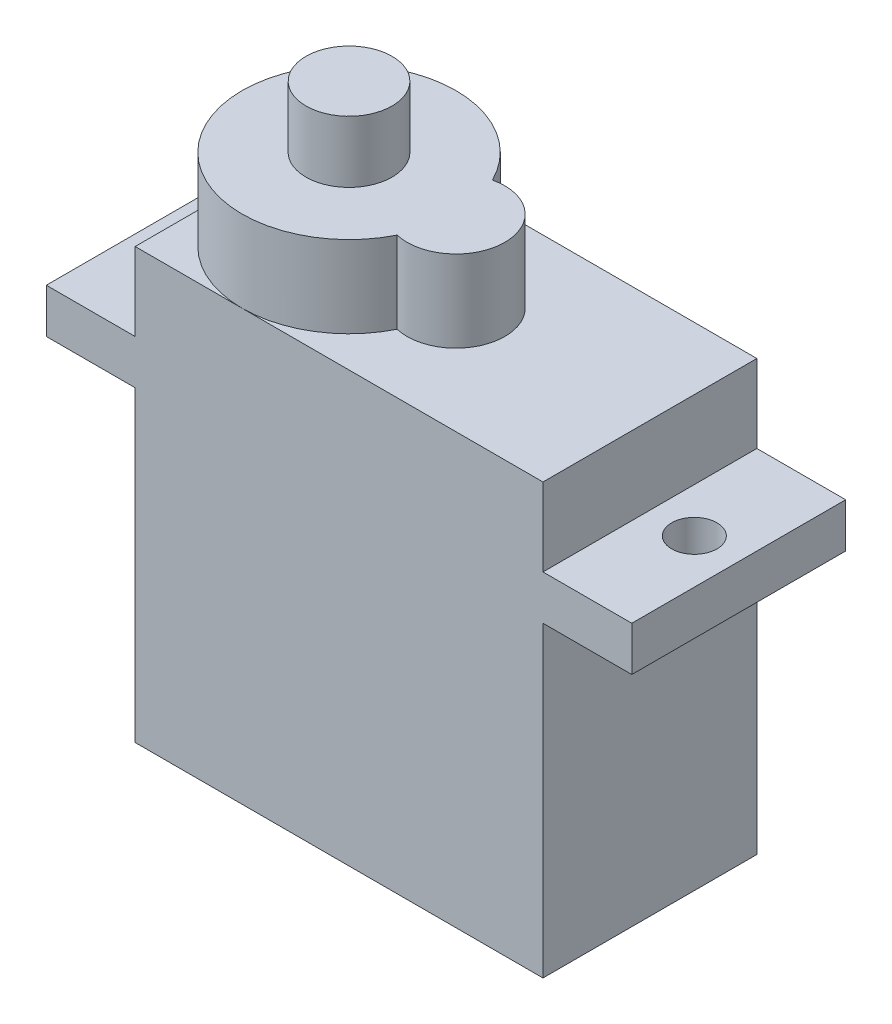
ISO-10303-21;
HEADER;
FILE_DESCRIPTION(('STEP AP214'),'2;1');
FILE_NAME('part.step','',(''),(''),'','','');
FILE_SCHEMA(('AUTOMOTIVE_DESIGN { 1 0 10303 214 1 1 1 1 }'));
ENDSEC;
DATA;
#1=APPLICATION_CONTEXT('core data for automotive mechanical design processes');
#2=APPLICATION_PROTOCOL_DEFINITION('international standard','automotive_design',2000,#1);
#3=PRODUCT_CONTEXT('',#1,'mechanical');
#4=PRODUCT('Part','Part','',(#3));
#5=PRODUCT_RELATED_PRODUCT_CATEGORY('part','',(#4));
#6=PRODUCT_DEFINITION_FORMATION('','',#4);
#7=PRODUCT_DEFINITION_CONTEXT('part definition',#1,'design');
#8=PRODUCT_DEFINITION('design','',#6,#7);
#9=PRODUCT_DEFINITION_SHAPE('','',#8);
#10=(LENGTH_UNIT() NAMED_UNIT(*) SI_UNIT(.MILLI.,.METRE.));
#11=(NAMED_UNIT(*) PLANE_ANGLE_UNIT() SI_UNIT($,.RADIAN.));
#12=(NAMED_UNIT(*) SI_UNIT($,.STERADIAN.) SOLID_ANGLE_UNIT());
#13=UNCERTAINTY_MEASURE_WITH_UNIT(LENGTH_MEASURE(1.E-05),#10,'distance_accuracy_value','');
#14=(GEOMETRIC_REPRESENTATION_CONTEXT(3) GLOBAL_UNCERTAINTY_ASSIGNED_CONTEXT((#13)) GLOBAL_UNIT_ASSIGNED_CONTEXT((#10,
#11,#12)) REPRESENTATION_CONTEXT('',''));
#15=CARTESIAN_POINT('',(0.,0.,0.));
#16=DIRECTION('',(0.,0.,1.));
#17=DIRECTION('',(1.,0.,0.));
#18=AXIS2_PLACEMENT_3D('',#15,#16,#17);
#19=CARTESIAN_POINT('',(0.,23.7,11.8));
#20=DIRECTION('',(0.,-1.,0.));
#21=DIRECTION('',(0.,0.,-1.));
#22=AXIS2_PLACEMENT_3D('',#19,#20,#21);
#23=PLANE('',#22);
#24=CARTESIAN_POINT('',(11.8,23.7,5.9));
#25=DIRECTION('',(0.,1.,0.));
#26=DIRECTION('',(0.,0.,1.));
#27=AXIS2_PLACEMENT_3D('',#24,#25,#26);
#28=CIRCLE('',#27,2.7);
#29=CARTESIAN_POINT('',(11.1822033898305,23.7,8.52836971304706));
#30=VERTEX_POINT('',#29);
#31=CARTESIAN_POINT('',(11.1822033898305,23.7,3.27163028695294));
#32=VERTEX_POINT('',#31);
#33=EDGE_CURVE('E166',#30,#32,#28,.T.);
#34=ORIENTED_EDGE('',*,*,#33,.F.);
#35=CARTESIAN_POINT('',(5.90000000000001,23.7,5.9));
#36=DIRECTION('',(0.,1.,0.));
#37=DIRECTION('',(0.,0.,1.));
#38=AXIS2_PLACEMENT_3D('',#35,#36,#37);
#39=CIRCLE('',#38,5.9);
#40=CARTESIAN_POINT('',(5.90000000000001,23.7,11.8));
#41=VERTEX_POINT('',#40);
#42=EDGE_CURVE('E61',#41,#30,#39,.T.);
#43=ORIENTED_EDGE('',*,*,#42,.F.);
#44=DIRECTION('',(-1.,0.,0.));
#45=VECTOR('',#44,1.);
#46=CARTESIAN_POINT('',(0.,23.7,11.8));
#47=LINE('',#46,#45);
#48=CARTESIAN_POINT('',(22.5,23.7,11.8));
#49=VERTEX_POINT('',#48);
#50=EDGE_CURVE('E191',#49,#41,#47,.T.);
#51=ORIENTED_EDGE('',*,*,#50,.F.);
#52=DIRECTION('',(0.,0.,-1.));
#53=VECTOR('',#52,1.);
#54=CARTESIAN_POINT('',(22.5,23.7,11.8));
#55=LINE('',#54,#53);
#56=CARTESIAN_POINT('',(22.5,23.7,0.));
#57=VERTEX_POINT('',#56);
#58=EDGE_CURVE('E239',#49,#57,#55,.T.);
#59=ORIENTED_EDGE('',*,*,#58,.T.);
#60=DIRECTION('',(-1.,0.,0.));
#61=VECTOR('',#60,1.);
#62=CARTESIAN_POINT('',(0.,23.7,0.));
#63=LINE('',#62,#61);
#64=CARTESIAN_POINT('',(5.90000000000001,23.7,0.));
#65=VERTEX_POINT('',#64);
#66=EDGE_CURVE('E215',#57,#65,#63,.T.);
#67=ORIENTED_EDGE('',*,*,#66,.T.);
#68=EDGE_CURVE('E49',#32,#65,#39,.T.);
#69=ORIENTED_EDGE('',*,*,#68,.F.);
#70=EDGE_LOOP('',(#34,#43,#51,#59,#67,#69));
#71=FACE_BOUND('',#70,.T.);
#72=ADVANCED_FACE('F38',(#71),#23,.F.);
#73=CARTESIAN_POINT('',(0.,23.7,5.9));
#74=VERTEX_POINT('',#73);
#75=EDGE_CURVE('E11',#65,#74,#39,.T.);
#76=ORIENTED_EDGE('',*,*,#75,.F.);
#77=CARTESIAN_POINT('',(0.,23.7,0.));
#78=VERTEX_POINT('',#77);
#79=EDGE_CURVE('E214',#65,#78,#63,.T.);
#80=ORIENTED_EDGE('',*,*,#79,.T.);
#81=DIRECTION('',(0.,0.,-1.));
#82=VECTOR('',#81,1.);
#83=CARTESIAN_POINT('',(0.,23.7,11.8));
#84=LINE('',#83,#82);
#85=EDGE_CURVE('E235',#74,#78,#84,.T.);
#86=ORIENTED_EDGE('',*,*,#85,.F.);
#87=EDGE_LOOP('',(#76,#80,#86));
#88=FACE_BOUND('',#87,.T.);
#89=ADVANCED_FACE('F346',(#88),#23,.F.);
#90=CARTESIAN_POINT('',(0.,0.,11.8));
#91=DIRECTION('',(1.,0.,0.));
#92=DIRECTION('',(0.,0.,-1.));
#93=AXIS2_PLACEMENT_3D('',#90,#91,#92);
#94=PLANE('',#93);
#95=DIRECTION('',(0.,-1.,0.));
#96=VECTOR('',#95,1.);
#97=CARTESIAN_POINT('',(0.,0.,0.));
#98=LINE('',#97,#96);
#99=CARTESIAN_POINT('',(0.,16.95,0.));
#100=VERTEX_POINT('',#99);
#101=CARTESIAN_POINT('',(0.,0.,0.));
#102=VERTEX_POINT('',#101);
#103=EDGE_CURVE('E167',#100,#102,#98,.T.);
#104=ORIENTED_EDGE('',*,*,#103,.T.);
#105=DIRECTION('',(0.,0.,-1.));
#106=VECTOR('',#105,1.);
#107=CARTESIAN_POINT('',(0.,0.,11.8));
#108=LINE('',#107,#106);
#109=CARTESIAN_POINT('',(0.,0.,11.8));
#110=VERTEX_POINT('',#109);
#111=EDGE_CURVE('E42',#110,#102,#108,.T.);
#112=ORIENTED_EDGE('',*,*,#111,.F.);
#113=DIRECTION('',(0.,-1.,0.));
#114=VECTOR('',#113,1.);
#115=CARTESIAN_POINT('',(0.,0.,11.8));
#116=LINE('',#115,#114);
#117=CARTESIAN_POINT('',(0.,16.95,11.8));
#118=VERTEX_POINT('',#117);
#119=EDGE_CURVE('E174',#118,#110,#116,.T.);
#120=ORIENTED_EDGE('',*,*,#119,.F.);
#121=DIRECTION('',(0.,0.,-1.));
#122=VECTOR('',#121,1.);
#123=CARTESIAN_POINT('',(0.,16.95,11.8));
#124=LINE('',#123,#122);
#125=EDGE_CURVE('E201',#118,#100,#124,.T.);
#126=ORIENTED_EDGE('',*,*,#125,.T.);
#127=EDGE_LOOP('',(#104,#112,#120,#126));
#128=FACE_BOUND('',#127,.T.);
#129=ADVANCED_FACE('F40',(#128),#94,.F.);
#130=CARTESIAN_POINT('',(0.,0.,11.8));
#131=DIRECTION('',(0.,1.,0.));
#132=DIRECTION('',(0.,0.,1.));
#133=AXIS2_PLACEMENT_3D('',#130,#131,#132);
#134=PLANE('',#133);
#135=DIRECTION('',(1.,0.,0.));
#136=VECTOR('',#135,1.);
#137=CARTESIAN_POINT('',(0.,0.,0.));
#138=LINE('',#137,#136);
#139=CARTESIAN_POINT('',(22.5,0.,0.));
#140=VERTEX_POINT('',#139);
#141=EDGE_CURVE('E170',#102,#140,#138,.T.);
#142=ORIENTED_EDGE('',*,*,#141,.T.);
#143=DIRECTION('',(0.,0.,-1.));
#144=VECTOR('',#143,1.);
#145=CARTESIAN_POINT('',(22.5,0.,11.8));
#146=LINE('',#145,#144);
#147=CARTESIAN_POINT('',(22.5,0.,11.8));
#148=VERTEX_POINT('',#147);
#149=EDGE_CURVE('E253',#148,#140,#146,.T.);
#150=ORIENTED_EDGE('',*,*,#149,.F.);
#151=DIRECTION('',(1.,0.,0.));
#152=VECTOR('',#151,1.);
#153=CARTESIAN_POINT('',(0.,0.,11.8));
#154=LINE('',#153,#152);
#155=EDGE_CURVE('E177',#110,#148,#154,.T.);
#156=ORIENTED_EDGE('',*,*,#155,.F.);
#157=ORIENTED_EDGE('',*,*,#111,.T.);
#158=EDGE_LOOP('',(#142,#150,#156,#157));
#159=FACE_BOUND('',#158,.T.);
#160=ADVANCED_FACE('F353',(#159),#134,.F.);
#161=CARTESIAN_POINT('',(22.5,0.,11.8));
#162=DIRECTION('',(-1.,0.,0.));
#163=DIRECTION('',(0.,0.,1.));
#164=AXIS2_PLACEMENT_3D('',#161,#162,#163);
#165=PLANE('',#164);
#166=DIRECTION('',(0.,1.,0.));
#167=VECTOR('',#166,1.);
#168=CARTESIAN_POINT('',(22.5,0.,0.));
#169=LINE('',#168,#167);
#170=CARTESIAN_POINT('',(22.5,16.95,0.));
#171=VERTEX_POINT('',#170);
#172=EDGE_CURVE('E204',#140,#171,#169,.T.);
#173=ORIENTED_EDGE('',*,*,#172,.T.);
#174=DIRECTION('',(0.,0.,-1.));
#175=VECTOR('',#174,1.);
#176=CARTESIAN_POINT('',(22.5,16.95,11.8));
#177=LINE('',#176,#175);
#178=CARTESIAN_POINT('',(22.5,16.95,11.8));
#179=VERTEX_POINT('',#178);
#180=EDGE_CURVE('E251',#179,#171,#177,.T.);
#181=ORIENTED_EDGE('',*,*,#180,.F.);
#182=DIRECTION('',(0.,1.,0.));
#183=VECTOR('',#182,1.);
#184=CARTESIAN_POINT('',(22.5,0.,11.8));
#185=LINE('',#184,#183);
#186=EDGE_CURVE('E180',#148,#179,#185,.T.);
#187=ORIENTED_EDGE('',*,*,#186,.F.);
#188=ORIENTED_EDGE('',*,*,#149,.T.);
#189=EDGE_LOOP('',(#173,#181,#187,#188));
#190=FACE_BOUND('',#189,.T.);
#191=ADVANCED_FACE('F343',(#190),#165,.F.);
#192=CARTESIAN_POINT('',(27.4,16.95,11.8));
#193=DIRECTION('',(0.,1.,0.));
#194=DIRECTION('',(0.,0.,1.));
#195=AXIS2_PLACEMENT_3D('',#192,#193,#194);
#196=PLANE('',#195);
#197=CARTESIAN_POINT('',(24.95,16.95,5.9));
#198=DIRECTION('',(0.,1.,0.));
#199=DIRECTION('',(0.,0.,1.));
#200=AXIS2_PLACEMENT_3D('',#197,#198,#199);
#201=CIRCLE('',#200,1.25);
#202=CARTESIAN_POINT('',(24.95,16.95,7.15));
#203=VERTEX_POINT('',#202);
#204=EDGE_CURVE('E272',#203,#203,#201,.F.);
#205=ORIENTED_EDGE('',*,*,#204,.F.);
#206=EDGE_LOOP('',(#205));
#207=FACE_BOUND('',#206,.T.);
#208=DIRECTION('',(1.,0.,0.));
#209=VECTOR('',#208,1.);
#210=CARTESIAN_POINT('',(27.4,16.95,0.));
#211=LINE('',#210,#209);
#212=CARTESIAN_POINT('',(27.4,16.95,0.));
#213=VERTEX_POINT('',#212);
#214=EDGE_CURVE('E206',#171,#213,#211,.T.);
#215=ORIENTED_EDGE('',*,*,#214,.T.);
#216=DIRECTION('',(0.,0.,-1.));
#217=VECTOR('',#216,1.);
#218=CARTESIAN_POINT('',(27.4,16.95,11.8));
#219=LINE('',#218,#217);
#220=CARTESIAN_POINT('',(27.4,16.95,11.8));
#221=VERTEX_POINT('',#220);
#222=EDGE_CURVE('E248',#221,#213,#219,.T.);
#223=ORIENTED_EDGE('',*,*,#222,.F.);
#224=DIRECTION('',(1.,0.,0.));
#225=VECTOR('',#224,1.);
#226=CARTESIAN_POINT('',(27.4,16.95,11.8));
#227=LINE('',#226,#225);
#228=EDGE_CURVE('E182',#179,#221,#227,.T.);
#229=ORIENTED_EDGE('',*,*,#228,.F.);
#230=ORIENTED_EDGE('',*,*,#180,.T.);
#231=EDGE_LOOP('',(#215,#223,#229,#230));
#232=FACE_BOUND('',#231,.T.);
#233=ADVANCED_FACE('F341',(#207,#232),#196,.F.);
#234=CARTESIAN_POINT('',(27.4,19.4,11.8));
#235=DIRECTION('',(-1.,0.,0.));
#236=DIRECTION('',(0.,0.,1.));
#237=AXIS2_PLACEMENT_3D('',#234,#235,#236);
#238=PLANE('',#237);
#239=DIRECTION('',(0.,1.,0.));
#240=VECTOR('',#239,1.);
#241=CARTESIAN_POINT('',(27.4,19.4,0.));
#242=LINE('',#241,#240);
#243=CARTESIAN_POINT('',(27.4,19.4,0.));
#244=VERTEX_POINT('',#243);
#245=EDGE_CURVE('E208',#213,#244,#242,.T.);
#246=ORIENTED_EDGE('',*,*,#245,.T.);
#247=DIRECTION('',(0.,0.,-1.));
#248=VECTOR('',#247,1.);
#249=CARTESIAN_POINT('',(27.4,19.4,11.8));
#250=LINE('',#249,#248);
#251=CARTESIAN_POINT('',(27.4,19.4,11.8));
#252=VERTEX_POINT('',#251);
#253=EDGE_CURVE('E245',#252,#244,#250,.T.);
#254=ORIENTED_EDGE('',*,*,#253,.F.);
#255=DIRECTION('',(0.,1.,0.));
#256=VECTOR('',#255,1.);
#257=CARTESIAN_POINT('',(27.4,19.4,11.8));
#258=LINE('',#257,#256);
#259=EDGE_CURVE('E184',#221,#252,#258,.T.);
#260=ORIENTED_EDGE('',*,*,#259,.F.);
#261=ORIENTED_EDGE('',*,*,#222,.T.);
#262=EDGE_LOOP('',(#246,#254,#260,#261));
#263=FACE_BOUND('',#262,.T.);
#264=ADVANCED_FACE('F337',(#263),#238,.F.);
#265=CARTESIAN_POINT('',(22.5,19.4,11.8));
#266=DIRECTION('',(0.,-1.,0.));
#267=DIRECTION('',(0.,0.,-1.));
#268=AXIS2_PLACEMENT_3D('',#265,#266,#267);
#269=PLANE('',#268);
#270=CARTESIAN_POINT('',(24.95,19.4,5.9));
#271=DIRECTION('',(0.,1.,0.));
#272=DIRECTION('',(0.,0.,1.));
#273=AXIS2_PLACEMENT_3D('',#270,#271,#272);
#274=CIRCLE('',#273,1.25);
#275=CARTESIAN_POINT('',(24.95,19.4,7.15));
#276=VERTEX_POINT('',#275);
#277=EDGE_CURVE('E276',#276,#276,#274,.T.);
#278=ORIENTED_EDGE('',*,*,#277,.F.);
#279=EDGE_LOOP('',(#278));
#280=FACE_BOUND('',#279,.T.);
#281=DIRECTION('',(-1.,0.,0.));
#282=VECTOR('',#281,1.);
#283=CARTESIAN_POINT('',(22.5,19.4,0.));
#284=LINE('',#283,#282);
#285=CARTESIAN_POINT('',(22.5,19.4,0.));
#286=VERTEX_POINT('',#285);
#287=EDGE_CURVE('E210',#244,#286,#284,.T.);
#288=ORIENTED_EDGE('',*,*,#287,.T.);
#289=DIRECTION('',(0.,0.,-1.));
#290=VECTOR('',#289,1.);
#291=CARTESIAN_POINT('',(22.5,19.4,11.8));
#292=LINE('',#291,#290);
#293=CARTESIAN_POINT('',(22.5,19.4,11.8));
#294=VERTEX_POINT('',#293);
#295=EDGE_CURVE('E242',#294,#286,#292,.T.);
#296=ORIENTED_EDGE('',*,*,#295,.F.);
#297=DIRECTION('',(-1.,0.,0.));
#298=VECTOR('',#297,1.);
#299=CARTESIAN_POINT('',(22.5,19.4,11.8));
#300=LINE('',#299,#298);
#301=EDGE_CURVE('E186',#252,#294,#300,.T.);
#302=ORIENTED_EDGE('',*,*,#301,.F.);
#303=ORIENTED_EDGE('',*,*,#253,.T.);
#304=EDGE_LOOP('',(#288,#296,#302,#303));
#305=FACE_BOUND('',#304,.T.);
#306=ADVANCED_FACE('F332',(#280,#305),#269,.F.);
#307=CARTESIAN_POINT('',(22.5,19.4,11.8));
#308=DIRECTION('',(-1.,0.,0.));
#309=DIRECTION('',(0.,0.,1.));
#310=AXIS2_PLACEMENT_3D('',#307,#308,#309);
#311=PLANE('',#310);
#312=DIRECTION('',(0.,1.,0.));
#313=VECTOR('',#312,1.);
#314=CARTESIAN_POINT('',(22.5,19.4,0.));
#315=LINE('',#314,#313);
#316=EDGE_CURVE('E212',#286,#57,#315,.T.);
#317=ORIENTED_EDGE('',*,*,#316,.T.);
#318=ORIENTED_EDGE('',*,*,#58,.F.);
#319=DIRECTION('',(0.,1.,0.));
#320=VECTOR('',#319,1.);
#321=CARTESIAN_POINT('',(22.5,19.4,11.8));
#322=LINE('',#321,#320);
#323=EDGE_CURVE('E188',#294,#49,#322,.T.);
#324=ORIENTED_EDGE('',*,*,#323,.F.);
#325=ORIENTED_EDGE('',*,*,#295,.T.);
#326=EDGE_LOOP('',(#317,#318,#324,#325));
#327=FACE_BOUND('',#326,.T.);
#328=ADVANCED_FACE('F326',(#327),#311,.F.);
#329=EDGE_CURVE('E47',#74,#41,#39,.T.);
#330=ORIENTED_EDGE('',*,*,#329,.F.);
#331=CARTESIAN_POINT('',(0.,23.7,11.8));
#332=VERTEX_POINT('',#331);
#333=EDGE_CURVE('E236',#332,#74,#84,.T.);
#334=ORIENTED_EDGE('',*,*,#333,.F.);
#335=EDGE_CURVE('E190',#41,#332,#47,.T.);
#336=ORIENTED_EDGE('',*,*,#335,.F.);
#337=EDGE_LOOP('',(#330,#334,#336));
#338=FACE_BOUND('',#337,.T.);
#339=ADVANCED_FACE('F345',(#338),#23,.F.);
#340=CARTESIAN_POINT('',(0.,19.4,11.8));
#341=DIRECTION('',(1.,0.,0.));
#342=DIRECTION('',(0.,1.,0.));
#343=AXIS2_PLACEMENT_3D('',#340,#341,#342);
#344=PLANE('',#343);
#345=DIRECTION('',(0.,-1.,0.));
#346=VECTOR('',#345,1.);
#347=CARTESIAN_POINT('',(0.,19.4,0.));
#348=LINE('',#347,#346);
#349=CARTESIAN_POINT('',(0.,19.4,0.));
#350=VERTEX_POINT('',#349);
#351=EDGE_CURVE('E217',#78,#350,#348,.T.);
#352=ORIENTED_EDGE('',*,*,#351,.T.);
#353=DIRECTION('',(0.,0.,-1.));
#354=VECTOR('',#353,1.);
#355=CARTESIAN_POINT('',(0.,19.4,11.8));
#356=LINE('',#355,#354);
#357=CARTESIAN_POINT('',(0.,19.4,11.8));
#358=VERTEX_POINT('',#357);
#359=EDGE_CURVE('E232',#358,#350,#356,.T.);
#360=ORIENTED_EDGE('',*,*,#359,.F.);
#361=DIRECTION('',(0.,-1.,0.));
#362=VECTOR('',#361,1.);
#363=CARTESIAN_POINT('',(0.,19.4,11.8));
#364=LINE('',#363,#362);
#365=EDGE_CURVE('E194',#332,#358,#364,.T.);
#366=ORIENTED_EDGE('',*,*,#365,.F.);
#367=ORIENTED_EDGE('',*,*,#333,.T.);
#368=ORIENTED_EDGE('',*,*,#85,.T.);
#369=EDGE_LOOP('',(#352,#360,#366,#367,#368));
#370=FACE_BOUND('',#369,.T.);
#371=ADVANCED_FACE('F291',(#370),#344,.F.);
#372=CARTESIAN_POINT('',(-4.9,19.4,11.8));
#373=DIRECTION('',(0.,-1.,0.));
#374=DIRECTION('',(0.,0.,-1.));
#375=AXIS2_PLACEMENT_3D('',#372,#373,#374);
#376=PLANE('',#375);
#377=CARTESIAN_POINT('',(-2.45,19.4,5.9));
#378=DIRECTION('',(0.,1.,0.));
#379=DIRECTION('',(0.,0.,1.));
#380=AXIS2_PLACEMENT_3D('',#377,#378,#379);
#381=CIRCLE('',#380,1.25);
#382=CARTESIAN_POINT('',(-2.45,19.4,7.15));
#383=VERTEX_POINT('',#382);
#384=EDGE_CURVE('E275',#383,#383,#381,.T.);
#385=ORIENTED_EDGE('',*,*,#384,.F.);
#386=EDGE_LOOP('',(#385));
#387=FACE_BOUND('',#386,.T.);
#388=DIRECTION('',(-1.,0.,0.));
#389=VECTOR('',#388,1.);
#390=CARTESIAN_POINT('',(-4.9,19.4,0.));
#391=LINE('',#390,#389);
#392=CARTESIAN_POINT('',(-4.9,19.4,0.));
#393=VERTEX_POINT('',#392);
#394=EDGE_CURVE('E219',#350,#393,#391,.T.);
#395=ORIENTED_EDGE('',*,*,#394,.T.);
#396=DIRECTION('',(0.,0.,-1.));
#397=VECTOR('',#396,1.);
#398=CARTESIAN_POINT('',(-4.9,19.4,11.8));
#399=LINE('',#398,#397);
#400=CARTESIAN_POINT('',(-4.9,19.4,11.8));
#401=VERTEX_POINT('',#400);
#402=EDGE_CURVE('E229',#401,#393,#399,.T.);
#403=ORIENTED_EDGE('',*,*,#402,.F.);
#404=DIRECTION('',(-1.,0.,0.));
#405=VECTOR('',#404,1.);
#406=CARTESIAN_POINT('',(-4.9,19.4,11.8));
#407=LINE('',#406,#405);
#408=EDGE_CURVE('E196',#358,#401,#407,.T.);
#409=ORIENTED_EDGE('',*,*,#408,.F.);
#410=ORIENTED_EDGE('',*,*,#359,.T.);
#411=EDGE_LOOP('',(#395,#403,#409,#410));
#412=FACE_BOUND('',#411,.T.);
#413=ADVANCED_FACE('F287',(#387,#412),#376,.F.);
#414=CARTESIAN_POINT('',(-4.9,16.95,11.8));
#415=DIRECTION('',(1.,0.,0.));
#416=DIRECTION('',(0.,0.,-1.));
#417=AXIS2_PLACEMENT_3D('',#414,#415,#416);
#418=PLANE('',#417);
#419=DIRECTION('',(0.,-1.,0.));
#420=VECTOR('',#419,1.);
#421=CARTESIAN_POINT('',(-4.9,16.95,0.));
#422=LINE('',#421,#420);
#423=CARTESIAN_POINT('',(-4.9,16.95,0.));
#424=VERTEX_POINT('',#423);
#425=EDGE_CURVE('E221',#393,#424,#422,.T.);
#426=ORIENTED_EDGE('',*,*,#425,.T.);
#427=DIRECTION('',(0.,0.,-1.));
#428=VECTOR('',#427,1.);
#429=CARTESIAN_POINT('',(-4.9,16.95,11.8));
#430=LINE('',#429,#428);
#431=CARTESIAN_POINT('',(-4.9,16.95,11.8));
#432=VERTEX_POINT('',#431);
#433=EDGE_CURVE('E226',#432,#424,#430,.T.);
#434=ORIENTED_EDGE('',*,*,#433,.F.);
#435=DIRECTION('',(0.,-1.,0.));
#436=VECTOR('',#435,1.);
#437=CARTESIAN_POINT('',(-4.9,16.95,11.8));
#438=LINE('',#437,#436);
#439=EDGE_CURVE('E198',#401,#432,#438,.T.);
#440=ORIENTED_EDGE('',*,*,#439,.F.);
#441=ORIENTED_EDGE('',*,*,#402,.T.);
#442=EDGE_LOOP('',(#426,#434,#440,#441));
#443=FACE_BOUND('',#442,.T.);
#444=ADVANCED_FACE('F290',(#443),#418,.F.);
#445=CARTESIAN_POINT('',(0.,16.95,11.8));
#446=DIRECTION('',(0.,1.,0.));
#447=DIRECTION('',(0.,0.,1.));
#448=AXIS2_PLACEMENT_3D('',#445,#446,#447);
#449=PLANE('',#448);
#450=CARTESIAN_POINT('',(-2.45,16.95,5.9));
#451=DIRECTION('',(0.,1.,0.));
#452=DIRECTION('',(0.,0.,1.));
#453=AXIS2_PLACEMENT_3D('',#450,#451,#452);
#454=CIRCLE('',#453,1.25);
#455=CARTESIAN_POINT('',(-2.45,16.95,7.15));
#456=VERTEX_POINT('',#455);
#457=EDGE_CURVE('E270',#456,#456,#454,.F.);
#458=ORIENTED_EDGE('',*,*,#457,.F.);
#459=EDGE_LOOP('',(#458));
#460=FACE_BOUND('',#459,.T.);
#461=DIRECTION('',(1.,0.,0.));
#462=VECTOR('',#461,1.);
#463=CARTESIAN_POINT('',(0.,16.95,0.));
#464=LINE('',#463,#462);
#465=EDGE_CURVE('E178',#424,#100,#464,.T.);
#466=ORIENTED_EDGE('',*,*,#465,.T.);
#467=ORIENTED_EDGE('',*,*,#125,.F.);
#468=DIRECTION('',(1.,0.,0.));
#469=VECTOR('',#468,1.);
#470=CARTESIAN_POINT('',(0.,16.95,11.8));
#471=LINE('',#470,#469);
#472=EDGE_CURVE('E200',#432,#118,#471,.T.);
#473=ORIENTED_EDGE('',*,*,#472,.F.);
#474=ORIENTED_EDGE('',*,*,#433,.T.);
#475=EDGE_LOOP('',(#466,#467,#473,#474));
#476=FACE_BOUND('',#475,.T.);
#477=ADVANCED_FACE('F308',(#460,#476),#449,.F.);
#478=CARTESIAN_POINT('',(0.,0.,11.8));
#479=DIRECTION('',(0.,0.,1.));
#480=DIRECTION('',(1.,0.,0.));
#481=AXIS2_PLACEMENT_3D('',#478,#479,#480);
#482=PLANE('',#481);
#483=ORIENTED_EDGE('',*,*,#119,.T.);
#484=ORIENTED_EDGE('',*,*,#155,.T.);
#485=ORIENTED_EDGE('',*,*,#186,.T.);
#486=ORIENTED_EDGE('',*,*,#228,.T.);
#487=ORIENTED_EDGE('',*,*,#259,.T.);
#488=ORIENTED_EDGE('',*,*,#301,.T.);
#489=ORIENTED_EDGE('',*,*,#323,.T.);
#490=ORIENTED_EDGE('',*,*,#50,.T.);
#491=ORIENTED_EDGE('',*,*,#335,.T.);
#492=ORIENTED_EDGE('',*,*,#365,.T.);
#493=ORIENTED_EDGE('',*,*,#408,.T.);
#494=ORIENTED_EDGE('',*,*,#439,.T.);
#495=ORIENTED_EDGE('',*,*,#472,.T.);
#496=EDGE_LOOP('',(#483,#484,#485,#486,#487,#488,#489,#490,#491,#492,#493,#494,#495));
#497=FACE_BOUND('',#496,.T.);
#498=ADVANCED_FACE('F313',(#497),#482,.T.);
#499=CARTESIAN_POINT('',(0.,0.,0.));
#500=DIRECTION('',(0.,0.,1.));
#501=DIRECTION('',(1.,0.,0.));
#502=AXIS2_PLACEMENT_3D('',#499,#500,#501);
#503=PLANE('',#502);
#504=ORIENTED_EDGE('',*,*,#103,.F.);
#505=ORIENTED_EDGE('',*,*,#465,.F.);
#506=ORIENTED_EDGE('',*,*,#425,.F.);
#507=ORIENTED_EDGE('',*,*,#394,.F.);
#508=ORIENTED_EDGE('',*,*,#351,.F.);
#509=ORIENTED_EDGE('',*,*,#79,.F.);
#510=ORIENTED_EDGE('',*,*,#66,.F.);
#511=ORIENTED_EDGE('',*,*,#316,.F.);
#512=ORIENTED_EDGE('',*,*,#287,.F.);
#513=ORIENTED_EDGE('',*,*,#245,.F.);
#514=ORIENTED_EDGE('',*,*,#214,.F.);
#515=ORIENTED_EDGE('',*,*,#172,.F.);
#516=ORIENTED_EDGE('',*,*,#141,.F.);
#517=EDGE_LOOP('',(#504,#505,#506,#507,#508,#509,#510,#511,#512,#513,#514,#515,#516));
#518=FACE_BOUND('',#517,.T.);
#519=ADVANCED_FACE('F305',(#518),#503,.F.);
#520=CARTESIAN_POINT('',(11.8,28.2,5.9));
#521=DIRECTION('',(0.,-1.,0.));
#522=DIRECTION('',(0.,0.,-1.));
#523=AXIS2_PLACEMENT_3D('',#520,#521,#522);
#524=CYLINDRICAL_SURFACE('',#523,2.7);
#525=ORIENTED_EDGE('',*,*,#33,.T.);
#526=DIRECTION('',(0.,-1.,0.));
#527=VECTOR('',#526,1.);
#528=CARTESIAN_POINT('',(11.1822033898305,28.2,3.27163028695294));
#529=LINE('',#528,#527);
#530=CARTESIAN_POINT('',(11.1822033898305,28.2,3.27163028695294));
#531=VERTEX_POINT('',#530);
#532=EDGE_CURVE('E154',#531,#32,#529,.T.);
#533=ORIENTED_EDGE('',*,*,#532,.F.);
#534=CARTESIAN_POINT('',(11.8,28.2,5.9));
#535=DIRECTION('',(0.,1.,0.));
#536=DIRECTION('',(0.,0.,1.));
#537=AXIS2_PLACEMENT_3D('',#534,#535,#536);
#538=CIRCLE('',#537,2.7);
#539=CARTESIAN_POINT('',(11.1822033898305,28.2,8.52836971304706));
#540=VERTEX_POINT('',#539);
#541=EDGE_CURVE('E160',#540,#531,#538,.T.);
#542=ORIENTED_EDGE('',*,*,#541,.F.);
#543=DIRECTION('',(0.,-1.,0.));
#544=VECTOR('',#543,1.);
#545=CARTESIAN_POINT('',(11.1822033898305,28.2,8.52836971304706));
#546=LINE('',#545,#544);
#547=EDGE_CURVE('E157',#540,#30,#546,.T.);
#548=ORIENTED_EDGE('',*,*,#547,.T.);
#549=EDGE_LOOP('',(#525,#533,#542,#548));
#550=FACE_BOUND('',#549,.T.);
#551=ADVANCED_FACE('F165',(#550),#524,.T.);
#552=CARTESIAN_POINT('',(5.90000000000001,28.2,5.9));
#553=DIRECTION('',(0.,-1.,0.));
#554=DIRECTION('',(0.,0.,-1.));
#555=AXIS2_PLACEMENT_3D('',#552,#553,#554);
#556=CYLINDRICAL_SURFACE('',#555,5.9);
#557=ORIENTED_EDGE('',*,*,#68,.T.);
#558=ORIENTED_EDGE('',*,*,#75,.T.);
#559=ORIENTED_EDGE('',*,*,#329,.T.);
#560=ORIENTED_EDGE('',*,*,#42,.T.);
#561=ORIENTED_EDGE('',*,*,#547,.F.);
#562=CARTESIAN_POINT('',(5.90000000000001,28.2,5.9));
#563=DIRECTION('',(0.,1.,0.));
#564=DIRECTION('',(0.,0.,1.));
#565=AXIS2_PLACEMENT_3D('',#562,#563,#564);
#566=CIRCLE('',#565,5.9);
#567=EDGE_CURVE('E150',#531,#540,#566,.T.);
#568=ORIENTED_EDGE('',*,*,#567,.F.);
#569=ORIENTED_EDGE('',*,*,#532,.T.);
#570=EDGE_LOOP('',(#557,#558,#559,#560,#561,#568,#569));
#571=FACE_BOUND('',#570,.T.);
#572=ADVANCED_FACE('F152',(#571),#556,.T.);
#573=CARTESIAN_POINT('',(8.85000000000001,28.2,5.9));
#574=DIRECTION('',(0.,1.,0.));
#575=DIRECTION('',(0.,0.,1.));
#576=AXIS2_PLACEMENT_3D('',#573,#574,#575);
#577=PLANE('',#576);
#578=CARTESIAN_POINT('',(5.90000000000001,28.2,5.9));
#579=DIRECTION('',(0.,1.,0.));
#580=DIRECTION('',(0.,0.,1.));
#581=AXIS2_PLACEMENT_3D('',#578,#579,#580);
#582=CIRCLE('',#581,2.375);
#583=CARTESIAN_POINT('',(5.90000000000001,28.2,8.275));
#584=VERTEX_POINT('',#583);
#585=EDGE_CURVE('E266',#584,#584,#582,.T.);
#586=ORIENTED_EDGE('',*,*,#585,.F.);
#587=EDGE_LOOP('',(#586));
#588=FACE_BOUND('',#587,.T.);
#589=ORIENTED_EDGE('',*,*,#541,.T.);
#590=ORIENTED_EDGE('',*,*,#567,.T.);
#591=EDGE_LOOP('',(#589,#590));
#592=FACE_BOUND('',#591,.T.);
#593=ADVANCED_FACE('F162',(#588,#592),#577,.T.);
#594=CARTESIAN_POINT('',(5.90000000000001,31.6,5.9));
#595=DIRECTION('',(0.,-1.,0.));
#596=DIRECTION('',(0.,0.,-1.));
#597=AXIS2_PLACEMENT_3D('',#594,#595,#596);
#598=CYLINDRICAL_SURFACE('',#597,2.375);
#599=CARTESIAN_POINT('',(5.90000000000001,31.6,5.9));
#600=DIRECTION('',(0.,1.,0.));
#601=DIRECTION('',(0.,0.,1.));
#602=AXIS2_PLACEMENT_3D('',#599,#600,#601);
#603=CIRCLE('',#602,2.375);
#604=CARTESIAN_POINT('',(5.90000000000001,31.6,8.275));
#605=VERTEX_POINT('',#604);
#606=EDGE_CURVE('E264',#605,#605,#603,.T.);
#607=ORIENTED_EDGE('',*,*,#606,.F.);
#608=EDGE_LOOP('',(#607));
#609=FACE_BOUND('',#608,.T.);
#610=ORIENTED_EDGE('',*,*,#585,.T.);
#611=EDGE_LOOP('',(#610));
#612=FACE_BOUND('',#611,.T.);
#613=ADVANCED_FACE('F444',(#609,#612),#598,.T.);
#614=CARTESIAN_POINT('',(5.90000000000001,31.6,5.9));
#615=DIRECTION('',(0.,1.,0.));
#616=DIRECTION('',(0.,0.,1.));
#617=AXIS2_PLACEMENT_3D('',#614,#615,#616);
#618=PLANE('',#617);
#619=ORIENTED_EDGE('',*,*,#606,.T.);
#620=EDGE_LOOP('',(#619));
#621=FACE_BOUND('',#620,.T.);
#622=ADVANCED_FACE('F426',(#621),#618,.T.);
#623=CARTESIAN_POINT('',(-2.45,-0.001000000000001,5.9));
#624=DIRECTION('',(0.,1.,0.));
#625=DIRECTION('',(0.,0.,1.));
#626=AXIS2_PLACEMENT_3D('',#623,#624,#625);
#627=CYLINDRICAL_SURFACE('',#626,1.25);
#628=ORIENTED_EDGE('',*,*,#384,.T.);
#629=EDGE_LOOP('',(#628));
#630=FACE_BOUND('',#629,.T.);
#631=ORIENTED_EDGE('',*,*,#457,.T.);
#632=EDGE_LOOP('',(#631));
#633=FACE_BOUND('',#632,.T.);
#634=ADVANCED_FACE('F284',(#630,#633),#627,.F.);
#635=CARTESIAN_POINT('',(24.95,-0.001000000000001,5.9));
#636=DIRECTION('',(0.,1.,0.));
#637=DIRECTION('',(0.,0.,1.));
#638=AXIS2_PLACEMENT_3D('',#635,#636,#637);
#639=CYLINDRICAL_SURFACE('',#638,1.25);
#640=ORIENTED_EDGE('',*,*,#277,.T.);
#641=EDGE_LOOP('',(#640));
#642=FACE_BOUND('',#641,.T.);
#643=ORIENTED_EDGE('',*,*,#204,.T.);
#644=EDGE_LOOP('',(#643));
#645=FACE_BOUND('',#644,.T.);
#646=ADVANCED_FACE('F425',(#642,#645),#639,.F.);
#647=CLOSED_SHELL('',(#72,#89,#129,#160,#191,#233,#264,#306,#328,#339,#371,#413,#444,#477,#498,
#519,#551,#572,#593,#613,#622,#634,#646));
#648=MANIFOLD_SOLID_BREP('B2',#647);
#649=ADVANCED_BREP_SHAPE_REPRESENTATION('',(#18,#648),#14);
#650=SHAPE_DEFINITION_REPRESENTATION(#9,#649);
ENDSEC;
END-ISO-10303-21;
